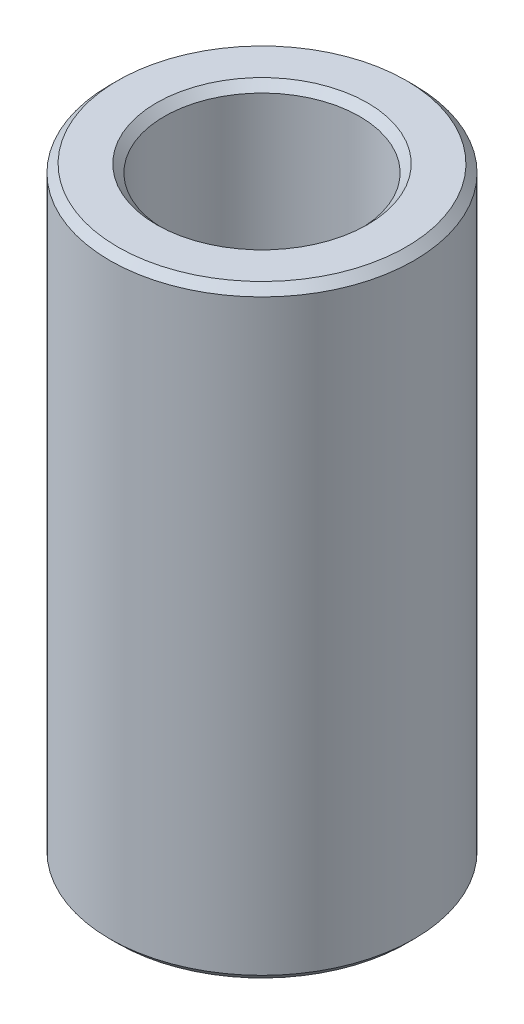
ISO-10303-21;
HEADER;
FILE_DESCRIPTION(('STEP AP214'),'2;1');
FILE_NAME('part.step','',(''),(''),'','','');
FILE_SCHEMA(('AUTOMOTIVE_DESIGN { 1 0 10303 214 1 1 1 1 }'));
ENDSEC;
DATA;
#1=APPLICATION_CONTEXT('core data for automotive mechanical design processes');
#2=APPLICATION_PROTOCOL_DEFINITION('international standard','automotive_design',2000,#1);
#3=PRODUCT_CONTEXT('',#1,'mechanical');
#4=PRODUCT('Part','Part','',(#3));
#5=PRODUCT_RELATED_PRODUCT_CATEGORY('part','',(#4));
#6=PRODUCT_DEFINITION_FORMATION('','',#4);
#7=PRODUCT_DEFINITION_CONTEXT('part definition',#1,'design');
#8=PRODUCT_DEFINITION('design','',#6,#7);
#9=PRODUCT_DEFINITION_SHAPE('','',#8);
#10=(LENGTH_UNIT() NAMED_UNIT(*) SI_UNIT(.MILLI.,.METRE.));
#11=(NAMED_UNIT(*) PLANE_ANGLE_UNIT() SI_UNIT($,.RADIAN.));
#12=(NAMED_UNIT(*) SI_UNIT($,.STERADIAN.) SOLID_ANGLE_UNIT());
#13=UNCERTAINTY_MEASURE_WITH_UNIT(LENGTH_MEASURE(1.E-05),#10,'distance_accuracy_value','');
#14=(GEOMETRIC_REPRESENTATION_CONTEXT(3) GLOBAL_UNCERTAINTY_ASSIGNED_CONTEXT((#13)) GLOBAL_UNIT_ASSIGNED_CONTEXT((#10,
#11,#12)) REPRESENTATION_CONTEXT('',''));
#15=CARTESIAN_POINT('',(0.,0.,0.));
#16=DIRECTION('',(0.,0.,1.));
#17=DIRECTION('',(1.,0.,0.));
#18=AXIS2_PLACEMENT_3D('',#15,#16,#17);
#19=CARTESIAN_POINT('',(0.,198.325745107293,0.));
#20=DIRECTION('',(0.,-1.,0.));
#21=DIRECTION('',(0.,0.,-1.));
#22=AXIS2_PLACEMENT_3D('',#19,#20,#21);
#23=CYLINDRICAL_SURFACE('',#22,50.);
#24=CARTESIAN_POINT('',(0.,2.58108688613978,0.));
#25=DIRECTION('',(0.,1.,0.));
#26=DIRECTION('',(0.,0.,1.));
#27=AXIS2_PLACEMENT_3D('',#24,#25,#26);
#28=CIRCLE('',#27,50.);
#29=CARTESIAN_POINT('',(0.,2.58108688613976,-50.));
#30=VERTEX_POINT('',#29);
#31=EDGE_CURVE('E10',#30,#30,#28,.T.);
#32=CARTESIAN_POINT('',(0.,195.744658221154,0.));
#33=DIRECTION('',(0.,1.,0.));
#34=DIRECTION('',(0.,0.,1.));
#35=AXIS2_PLACEMENT_3D('',#32,#33,#34);
#36=CIRCLE('',#35,50.);
#37=CARTESIAN_POINT('',(0.,195.744658221154,-50.));
#38=VERTEX_POINT('',#37);
#39=EDGE_CURVE('E50',#38,#38,#36,.F.);
#40=CARTESIAN_POINT('',(0.,2.58108688613976,-50.));
#41=CARTESIAN_POINT('',(0.,4.59320742087948,-50.));
#42=CARTESIAN_POINT('',(0.,6.60532795561922,-50.));
#43=CARTESIAN_POINT('',(0.,10.6295690250987,-50.));
#44=CARTESIAN_POINT('',(0.,12.6416895598384,-50.));
#45=CARTESIAN_POINT('',(0.,16.6659306293179,-50.));
#46=CARTESIAN_POINT('',(0.,18.6780511640576,-50.));
#47=CARTESIAN_POINT('',(0.,22.702292233537,-50.));
#48=CARTESIAN_POINT('',(0.,24.7144127682768,-50.));
#49=CARTESIAN_POINT('',(0.,28.7386538377562,-50.));
#50=CARTESIAN_POINT('',(0.,30.750774372496,-50.));
#51=CARTESIAN_POINT('',(0.,34.7750154419754,-50.));
#52=CARTESIAN_POINT('',(0.,36.7871359767151,-50.));
#53=CARTESIAN_POINT('',(0.,40.8113770461946,-50.));
#54=CARTESIAN_POINT('',(0.,42.8234975809343,-50.));
#55=CARTESIAN_POINT('',(0.,46.8477386504138,-50.));
#56=CARTESIAN_POINT('',(0.,48.8598591851535,-50.));
#57=CARTESIAN_POINT('',(0.,52.884100254633,-50.));
#58=CARTESIAN_POINT('',(0.,54.8962207893727,-50.));
#59=CARTESIAN_POINT('',(0.,58.9204618588522,-50.));
#60=CARTESIAN_POINT('',(0.,60.9325823935919,-50.));
#61=CARTESIAN_POINT('',(0.,64.9568234630713,-50.));
#62=CARTESIAN_POINT('',(0.,66.9689439978111,-50.));
#63=CARTESIAN_POINT('',(0.,70.9931850672905,-50.));
#64=CARTESIAN_POINT('',(0.,73.0053056020302,-50.));
#65=CARTESIAN_POINT('',(0.,77.0295466715097,-50.));
#66=CARTESIAN_POINT('',(0.,79.0416672062494,-50.));
#67=CARTESIAN_POINT('',(0.,83.0659082757289,-50.));
#68=CARTESIAN_POINT('',(0.,85.0780288104686,-50.));
#69=CARTESIAN_POINT('',(0.,89.1022698799481,-50.));
#70=CARTESIAN_POINT('',(0.,91.1143904146878,-50.));
#71=CARTESIAN_POINT('',(0.,95.1386314841673,-50.));
#72=CARTESIAN_POINT('',(0.,97.150752018907,-50.));
#73=CARTESIAN_POINT('',(0.,101.174993088386,-50.));
#74=CARTESIAN_POINT('',(0.,103.187113623126,-50.));
#75=CARTESIAN_POINT('',(0.,107.211354692606,-50.));
#76=CARTESIAN_POINT('',(0.,109.223475227345,-50.));
#77=CARTESIAN_POINT('',(0.,113.247716296825,-50.));
#78=CARTESIAN_POINT('',(0.,115.259836831565,-50.));
#79=CARTESIAN_POINT('',(0.,119.284077901044,-50.));
#80=CARTESIAN_POINT('',(0.,121.296198435784,-50.));
#81=CARTESIAN_POINT('',(0.,125.320439505263,-50.));
#82=CARTESIAN_POINT('',(0.,127.332560040003,-50.));
#83=CARTESIAN_POINT('',(0.,131.356801109482,-50.));
#84=CARTESIAN_POINT('',(0.,133.368921644222,-50.));
#85=CARTESIAN_POINT('',(0.,137.393162713702,-50.));
#86=CARTESIAN_POINT('',(0.,139.405283248441,-50.));
#87=CARTESIAN_POINT('',(0.,143.429524317921,-50.));
#88=CARTESIAN_POINT('',(0.,145.44164485266,-50.));
#89=CARTESIAN_POINT('',(0.,149.46588592214,-50.));
#90=CARTESIAN_POINT('',(0.,151.47800645688,-50.));
#91=CARTESIAN_POINT('',(0.,155.502247526359,-50.));
#92=CARTESIAN_POINT('',(0.,157.514368061099,-50.));
#93=CARTESIAN_POINT('',(0.,161.538609130578,-50.));
#94=CARTESIAN_POINT('',(0.,163.550729665318,-50.));
#95=CARTESIAN_POINT('',(0.,167.574970734797,-50.));
#96=CARTESIAN_POINT('',(0.,169.587091269537,-50.));
#97=CARTESIAN_POINT('',(0.,173.611332339017,-50.));
#98=CARTESIAN_POINT('',(0.,175.623452873756,-50.));
#99=CARTESIAN_POINT('',(0.,179.647693943236,-50.));
#100=CARTESIAN_POINT('',(0.,181.659814477976,-50.));
#101=CARTESIAN_POINT('',(0.,185.684055547455,-50.));
#102=CARTESIAN_POINT('',(0.,187.696176082195,-50.));
#103=CARTESIAN_POINT('',(0.,191.720417151674,-50.));
#104=CARTESIAN_POINT('',(0.,193.732537686414,-50.));
#105=CARTESIAN_POINT('',(0.,195.744658221154,-50.));
#106=B_SPLINE_CURVE_WITH_KNOTS('',3,(#40,#41,#42,#43,#44,#45,#46,#47,#48,#49,#50,#51,#52,#53,
#54,#55,#56,#57,#58,#59,#60,#61,#62,#63,#64,#65,#66,#67,#68,#69,#70,#71,#72,#73,#74,#75,#76,#77,
#78,#79,#80,#81,#82,#83,#84,#85,#86,#87,#88,#89,#90,#91,#92,#93,#94,#95,#96,#97,#98,#99,#100,
#101,#102,#103,#104,#105),.UNSPECIFIED.,.F.,.F.,(4,2,2,2,2,2,2,2,2,2,2,2,2,2,2,2,2,2,2,2,2,2,2,
2,2,2,2,2,2,2,2,2,4),(0.,6.03636160421919,12.0727232084384,18.1090848126575,24.1454464168767,
30.1818080210959,36.2181696253151,42.2545312295343,48.2908928337535,54.3272544379727,
60.3636160421919,66.399977646411,72.4363392506302,78.4727008548494,84.5090624590686,
90.5454240632878,96.581785667507,102.618147271726,108.654508875945,114.690870480165,
120.727232084384,126.763593688603,132.799955292822,138.836316897041,144.87267850126,
150.90904010548,156.945401709699,162.981763313918,169.018124918137,175.054486522356,
181.090848126576,187.127209730795,193.163571335014),.UNSPECIFIED.);
#107=EDGE_CURVE('BSEAM39',#30,#38,#106,.T.);
#108=ORIENTED_EDGE('',*,*,#31,.T.);
#109=ORIENTED_EDGE('',*,*,#39,.T.);
#110=ORIENTED_EDGE('',*,*,#107,.T.);
#111=ORIENTED_EDGE('',*,*,#107,.F.);
#112=EDGE_LOOP('',(#108,#110,#109,#111));
#113=FACE_BOUND('',#112,.T.);
#114=ADVANCED_FACE('F39',(#113),#23,.T.);
#115=CARTESIAN_POINT('',(0.,198.325745107293,0.));
#116=DIRECTION('',(0.,1.,0.));
#117=DIRECTION('',(0.,0.,1.));
#118=AXIS2_PLACEMENT_3D('',#115,#116,#117);
#119=PLANE('',#118);
#120=CARTESIAN_POINT('',(0.,198.325745107293,0.));
#121=DIRECTION('',(0.,1.,0.));
#122=DIRECTION('',(0.,0.,1.));
#123=AXIS2_PLACEMENT_3D('',#120,#121,#122);
#124=CIRCLE('',#123,34.6973389790828);
#125=CARTESIAN_POINT('',(0.,198.325745107293,34.6973389790828));
#126=VERTEX_POINT('',#125);
#127=EDGE_CURVE('E58',#126,#126,#124,.F.);
#128=ORIENTED_EDGE('',*,*,#127,.T.);
#129=EDGE_LOOP('',(#128));
#130=FACE_BOUND('',#129,.T.);
#131=CARTESIAN_POINT('',(0.,198.325745107293,0.));
#132=DIRECTION('',(0.,1.,0.));
#133=DIRECTION('',(0.,0.,1.));
#134=AXIS2_PLACEMENT_3D('',#131,#132,#133);
#135=CIRCLE('',#134,47.4189131138605);
#136=CARTESIAN_POINT('',(0.,198.325745107293,47.4189131138605));
#137=VERTEX_POINT('',#136);
#138=EDGE_CURVE('E61',#137,#137,#135,.T.);
#139=ORIENTED_EDGE('',*,*,#138,.T.);
#140=EDGE_LOOP('',(#139));
#141=FACE_BOUND('',#140,.T.);
#142=ADVANCED_FACE('F88',(#130,#141),#119,.T.);
#143=CARTESIAN_POINT('',(0.,0.,0.));
#144=DIRECTION('',(0.,1.,0.));
#145=DIRECTION('',(0.,0.,1.));
#146=AXIS2_PLACEMENT_3D('',#143,#144,#145);
#147=PLANE('',#146);
#148=CARTESIAN_POINT('',(0.,0.,0.));
#149=DIRECTION('',(0.,1.,0.));
#150=DIRECTION('',(0.,0.,1.));
#151=AXIS2_PLACEMENT_3D('',#148,#149,#150);
#152=CIRCLE('',#151,34.6973389790827);
#153=CARTESIAN_POINT('',(0.,0.,34.6973389790827));
#154=VERTEX_POINT('',#153);
#155=EDGE_CURVE('E51',#154,#154,#152,.T.);
#156=ORIENTED_EDGE('',*,*,#155,.T.);
#157=EDGE_LOOP('',(#156));
#158=FACE_BOUND('',#157,.T.);
#159=CARTESIAN_POINT('',(0.,0.,0.));
#160=DIRECTION('',(0.,1.,0.));
#161=DIRECTION('',(0.,0.,1.));
#162=AXIS2_PLACEMENT_3D('',#159,#160,#161);
#163=CIRCLE('',#162,47.4189131138602);
#164=CARTESIAN_POINT('',(0.,0.,47.4189131138602));
#165=VERTEX_POINT('',#164);
#166=EDGE_CURVE('E54',#165,#165,#163,.F.);
#167=ORIENTED_EDGE('',*,*,#166,.T.);
#168=EDGE_LOOP('',(#167));
#169=FACE_BOUND('',#168,.T.);
#170=ADVANCED_FACE('F83',(#158,#169),#147,.F.);
#171=CARTESIAN_POINT('',(0.,198.325745107293,0.));
#172=DIRECTION('',(0.,-1.,0.));
#173=DIRECTION('',(0.,0.,-1.));
#174=AXIS2_PLACEMENT_3D('',#171,#172,#173);
#175=CYLINDRICAL_SURFACE('',#174,32.116252092943);
#176=CARTESIAN_POINT('',(0.,195.744658221153,0.));
#177=DIRECTION('',(0.,1.,0.));
#178=DIRECTION('',(0.,0.,1.));
#179=AXIS2_PLACEMENT_3D('',#176,#177,#178);
#180=CIRCLE('',#179,32.116252092943);
#181=CARTESIAN_POINT('',(0.,195.744658221153,-32.116252092943));
#182=VERTEX_POINT('',#181);
#183=EDGE_CURVE('E67',#182,#182,#180,.T.);
#184=CARTESIAN_POINT('',(0.,2.58108688613967,0.));
#185=DIRECTION('',(0.,1.,0.));
#186=DIRECTION('',(0.,0.,1.));
#187=AXIS2_PLACEMENT_3D('',#184,#185,#186);
#188=CIRCLE('',#187,32.116252092943);
#189=CARTESIAN_POINT('',(0.,2.58108688613964,-32.116252092943));
#190=VERTEX_POINT('',#189);
#191=EDGE_CURVE('E69',#190,#190,#188,.F.);
#192=CARTESIAN_POINT('',(0.,195.744658221153,-32.116252092943));
#193=CARTESIAN_POINT('',(0.,193.732537686414,-32.116252092943));
#194=CARTESIAN_POINT('',(0.,191.720417151674,-32.116252092943));
#195=CARTESIAN_POINT('',(0.,187.696176082195,-32.116252092943));
#196=CARTESIAN_POINT('',(0.,185.684055547455,-32.116252092943));
#197=CARTESIAN_POINT('',(0.,181.659814477975,-32.116252092943));
#198=CARTESIAN_POINT('',(0.,179.647693943236,-32.116252092943));
#199=CARTESIAN_POINT('',(0.,175.623452873756,-32.116252092943));
#200=CARTESIAN_POINT('',(0.,173.611332339016,-32.116252092943));
#201=CARTESIAN_POINT('',(0.,169.587091269537,-32.116252092943));
#202=CARTESIAN_POINT('',(0.,167.574970734797,-32.116252092943));
#203=CARTESIAN_POINT('',(0.,163.550729665318,-32.116252092943));
#204=CARTESIAN_POINT('',(0.,161.538609130578,-32.116252092943));
#205=CARTESIAN_POINT('',(0.,157.514368061099,-32.116252092943));
#206=CARTESIAN_POINT('',(0.,155.502247526359,-32.116252092943));
#207=CARTESIAN_POINT('',(0.,151.478006456879,-32.116252092943));
#208=CARTESIAN_POINT('',(0.,149.46588592214,-32.116252092943));
#209=CARTESIAN_POINT('',(0.,145.44164485266,-32.116252092943));
#210=CARTESIAN_POINT('',(0.,143.429524317921,-32.116252092943));
#211=CARTESIAN_POINT('',(0.,139.405283248441,-32.116252092943));
#212=CARTESIAN_POINT('',(0.,137.393162713701,-32.116252092943));
#213=CARTESIAN_POINT('',(0.,133.368921644222,-32.116252092943));
#214=CARTESIAN_POINT('',(0.,131.356801109482,-32.116252092943));
#215=CARTESIAN_POINT('',(0.,127.332560040003,-32.116252092943));
#216=CARTESIAN_POINT('',(0.,125.320439505263,-32.116252092943));
#217=CARTESIAN_POINT('',(0.,121.296198435784,-32.116252092943));
#218=CARTESIAN_POINT('',(0.,119.284077901044,-32.116252092943));
#219=CARTESIAN_POINT('',(0.,115.259836831564,-32.116252092943));
#220=CARTESIAN_POINT('',(0.,113.247716296825,-32.116252092943));
#221=CARTESIAN_POINT('',(0.,109.223475227345,-32.116252092943));
#222=CARTESIAN_POINT('',(0.,107.211354692605,-32.116252092943));
#223=CARTESIAN_POINT('',(0.,103.187113623126,-32.116252092943));
#224=CARTESIAN_POINT('',(0.,101.174993088386,-32.116252092943));
#225=CARTESIAN_POINT('',(0.,97.1507520189068,-32.116252092943));
#226=CARTESIAN_POINT('',(0.,95.1386314841671,-32.116252092943));
#227=CARTESIAN_POINT('',(0.,91.1143904146877,-32.116252092943));
#228=CARTESIAN_POINT('',(0.,89.1022698799479,-32.116252092943));
#229=CARTESIAN_POINT('',(0.,85.0780288104685,-32.116252092943));
#230=CARTESIAN_POINT('',(0.,83.0659082757288,-32.116252092943));
#231=CARTESIAN_POINT('',(0.,79.0416672062493,-32.116252092943));
#232=CARTESIAN_POINT('',(0.,77.0295466715096,-32.116252092943));
#233=CARTESIAN_POINT('',(0.,73.0053056020301,-32.116252092943));
#234=CARTESIAN_POINT('',(0.,70.9931850672904,-32.116252092943));
#235=CARTESIAN_POINT('',(0.,66.9689439978109,-32.116252092943));
#236=CARTESIAN_POINT('',(0.,64.9568234630712,-32.116252092943));
#237=CARTESIAN_POINT('',(0.,60.9325823935918,-32.116252092943));
#238=CARTESIAN_POINT('',(0.,58.920461858852,-32.116252092943));
#239=CARTESIAN_POINT('',(0.,54.8962207893726,-32.116252092943));
#240=CARTESIAN_POINT('',(0.,52.8841002546328,-32.116252092943));
#241=CARTESIAN_POINT('',(0.,48.8598591851534,-32.116252092943));
#242=CARTESIAN_POINT('',(0.,46.8477386504137,-32.116252092943));
#243=CARTESIAN_POINT('',(0.,42.8234975809342,-32.116252092943));
#244=CARTESIAN_POINT('',(0.,40.8113770461945,-32.116252092943));
#245=CARTESIAN_POINT('',(0.,36.787135976715,-32.116252092943));
#246=CARTESIAN_POINT('',(0.,34.7750154419753,-32.116252092943));
#247=CARTESIAN_POINT('',(0.,30.7507743724958,-32.116252092943));
#248=CARTESIAN_POINT('',(0.,28.7386538377561,-32.116252092943));
#249=CARTESIAN_POINT('',(0.,24.7144127682767,-32.116252092943));
#250=CARTESIAN_POINT('',(0.,22.7022922335369,-32.116252092943));
#251=CARTESIAN_POINT('',(0.,18.6780511640575,-32.116252092943));
#252=CARTESIAN_POINT('',(0.,16.6659306293177,-32.116252092943));
#253=CARTESIAN_POINT('',(0.,12.6416895598383,-32.116252092943));
#254=CARTESIAN_POINT('',(0.,10.6295690250986,-32.116252092943));
#255=CARTESIAN_POINT('',(0.,6.60532795561911,-32.116252092943));
#256=CARTESIAN_POINT('',(0.,4.59320742087938,-32.116252092943));
#257=CARTESIAN_POINT('',(0.,2.58108688613964,-32.116252092943));
#258=B_SPLINE_CURVE_WITH_KNOTS('',3,(#192,#193,#194,#195,#196,#197,#198,#199,#200,#201,#202,
#203,#204,#205,#206,#207,#208,#209,#210,#211,#212,#213,#214,#215,#216,#217,#218,#219,#220,#221,
#222,#223,#224,#225,#226,#227,#228,#229,#230,#231,#232,#233,#234,#235,#236,#237,#238,#239,#240,
#241,#242,#243,#244,#245,#246,#247,#248,#249,#250,#251,#252,#253,#254,#255,#256,#257),
.UNSPECIFIED.,.F.,.F.,(4,2,2,2,2,2,2,2,2,2,2,2,2,2,2,2,2,2,2,2,2,2,2,2,2,2,2,2,2,2,2,2,4),(0.,
6.03636160421916,12.0727232084384,18.1090848126575,24.1454464168767,30.1818080210959,
36.2181696253151,42.2545312295343,48.2908928337535,54.3272544379726,60.3636160421918,
66.399977646411,72.4363392506302,78.4727008548494,84.5090624590685,90.5454240632877,
96.5817856675069,102.618147271726,108.654508875945,114.690870480164,120.727232084384,
126.763593688603,132.799955292822,138.836316897041,144.87267850126,150.90904010548,
156.945401709699,162.981763313918,169.018124918137,175.054486522356,181.090848126575,
187.127209730795,193.163571335014),.UNSPECIFIED.);
#259=EDGE_CURVE('BSEAM71',#182,#190,#258,.T.);
#260=ORIENTED_EDGE('',*,*,#183,.T.);
#261=ORIENTED_EDGE('',*,*,#191,.T.);
#262=ORIENTED_EDGE('',*,*,#259,.T.);
#263=ORIENTED_EDGE('',*,*,#259,.F.);
#264=EDGE_LOOP('',(#260,#262,#261,#263));
#265=FACE_BOUND('',#264,.T.);
#266=ADVANCED_FACE('F71',(#265),#175,.F.);
#267=CARTESIAN_POINT('',(0.,195.744658221153,0.));
#268=DIRECTION('',(0.,1.,0.));
#269=DIRECTION('',(0.,0.,1.));
#270=AXIS2_PLACEMENT_3D('',#267,#268,#269);
#271=CONICAL_SURFACE('',#270,32.116252092943,0.785398163397451);
#272=ORIENTED_EDGE('',*,*,#127,.F.);
#273=EDGE_LOOP('',(#272));
#274=FACE_BOUND('',#273,.T.);
#275=ORIENTED_EDGE('',*,*,#183,.F.);
#276=EDGE_LOOP('',(#275));
#277=FACE_BOUND('',#276,.T.);
#278=ADVANCED_FACE('F77',(#274,#277),#271,.F.);
#279=CARTESIAN_POINT('',(0.,0.,0.));
#280=DIRECTION('',(0.,-1.,0.));
#281=DIRECTION('',(0.,0.,-1.));
#282=AXIS2_PLACEMENT_3D('',#279,#280,#281);
#283=CONICAL_SURFACE('',#282,34.6973389790827,0.785398163397446);
#284=ORIENTED_EDGE('',*,*,#191,.F.);
#285=EDGE_LOOP('',(#284));
#286=FACE_BOUND('',#285,.T.);
#287=ORIENTED_EDGE('',*,*,#155,.F.);
#288=EDGE_LOOP('',(#287));
#289=FACE_BOUND('',#288,.T.);
#290=ADVANCED_FACE('F73',(#286,#289),#283,.F.);
#291=CARTESIAN_POINT('',(0.,2.58108688613978,0.));
#292=DIRECTION('',(0.,1.,0.));
#293=DIRECTION('',(0.,0.,1.));
#294=AXIS2_PLACEMENT_3D('',#291,#292,#293);
#295=CONICAL_SURFACE('',#294,50.,0.785398163397455);
#296=ORIENTED_EDGE('',*,*,#166,.F.);
#297=EDGE_LOOP('',(#296));
#298=FACE_BOUND('',#297,.T.);
#299=ORIENTED_EDGE('',*,*,#31,.F.);
#300=EDGE_LOOP('',(#299));
#301=FACE_BOUND('',#300,.T.);
#302=ADVANCED_FACE('F76',(#298,#301),#295,.T.);
#303=CARTESIAN_POINT('',(0.,198.325745107293,0.));
#304=DIRECTION('',(0.,-1.,0.));
#305=DIRECTION('',(0.,0.,-1.));
#306=AXIS2_PLACEMENT_3D('',#303,#304,#305);
#307=CONICAL_SURFACE('',#306,47.4189131138605,0.785398163397447);
#308=ORIENTED_EDGE('',*,*,#39,.F.);
#309=EDGE_LOOP('',(#308));
#310=FACE_BOUND('',#309,.T.);
#311=ORIENTED_EDGE('',*,*,#138,.F.);
#312=EDGE_LOOP('',(#311));
#313=FACE_BOUND('',#312,.T.);
#314=ADVANCED_FACE('F45',(#310,#313),#307,.T.);
#315=CLOSED_SHELL('',(#114,#142,#170,#266,#278,#290,#302,#314));
#316=MANIFOLD_SOLID_BREP('B2',#315);
#317=ADVANCED_BREP_SHAPE_REPRESENTATION('',(#18,#316),#14);
#318=SHAPE_DEFINITION_REPRESENTATION(#9,#317);
ENDSEC;
END-ISO-10303-21;
